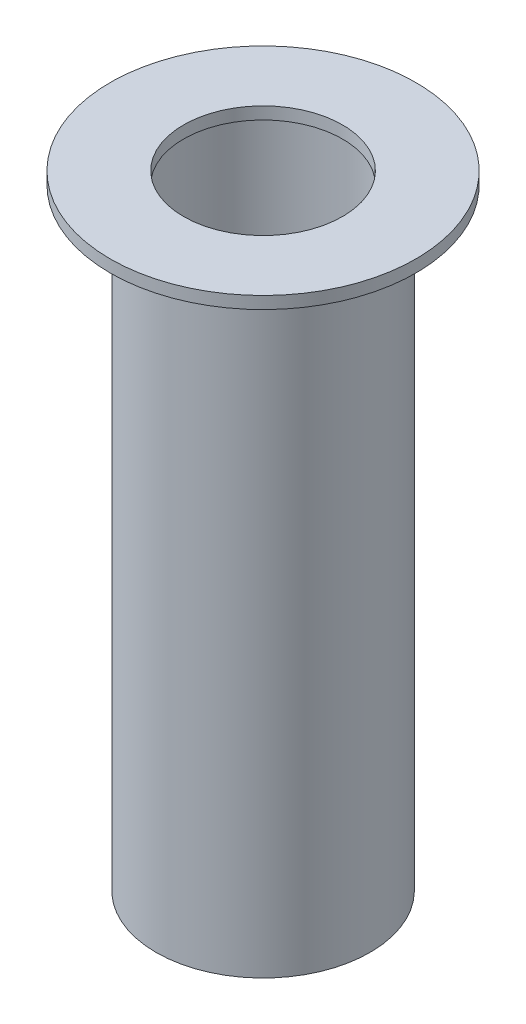
ISO-10303-21;
HEADER;
FILE_DESCRIPTION(('STEP AP214'),'2;1');
FILE_NAME('part.step','',(''),(''),'','','');
FILE_SCHEMA(('AUTOMOTIVE_DESIGN { 1 0 10303 214 1 1 1 1 }'));
ENDSEC;
DATA;
#1=APPLICATION_CONTEXT('core data for automotive mechanical design processes');
#2=APPLICATION_PROTOCOL_DEFINITION('international standard','automotive_design',2000,#1);
#3=PRODUCT_CONTEXT('',#1,'mechanical');
#4=PRODUCT('Part','Part','',(#3));
#5=PRODUCT_RELATED_PRODUCT_CATEGORY('part','',(#4));
#6=PRODUCT_DEFINITION_FORMATION('','',#4);
#7=PRODUCT_DEFINITION_CONTEXT('part definition',#1,'design');
#8=PRODUCT_DEFINITION('design','',#6,#7);
#9=PRODUCT_DEFINITION_SHAPE('','',#8);
#10=(LENGTH_UNIT() NAMED_UNIT(*) SI_UNIT(.MILLI.,.METRE.));
#11=(NAMED_UNIT(*) PLANE_ANGLE_UNIT() SI_UNIT($,.RADIAN.));
#12=(NAMED_UNIT(*) SI_UNIT($,.STERADIAN.) SOLID_ANGLE_UNIT());
#13=UNCERTAINTY_MEASURE_WITH_UNIT(LENGTH_MEASURE(1.E-05),#10,'distance_accuracy_value','');
#14=(GEOMETRIC_REPRESENTATION_CONTEXT(3) GLOBAL_UNCERTAINTY_ASSIGNED_CONTEXT((#13)) GLOBAL_UNIT_ASSIGNED_CONTEXT((#10,
#11,#12)) REPRESENTATION_CONTEXT('',''));
#15=CARTESIAN_POINT('',(0.,0.,0.));
#16=DIRECTION('',(0.,0.,1.));
#17=DIRECTION('',(1.,0.,0.));
#18=AXIS2_PLACEMENT_3D('',#15,#16,#17);
#19=CARTESIAN_POINT('',(0.,-20.,0.));
#20=DIRECTION('',(0.,1.,0.));
#21=DIRECTION('',(0.,0.,1.));
#22=AXIS2_PLACEMENT_3D('',#19,#20,#21);
#23=PLANE('',#22);
#24=CARTESIAN_POINT('',(0.,-20.,0.));
#25=DIRECTION('',(0.,1.,0.));
#26=DIRECTION('',(0.,0.,1.));
#27=AXIS2_PLACEMENT_3D('',#24,#25,#26);
#28=CIRCLE('',#27,7.);
#29=CARTESIAN_POINT('',(0.,-20.,7.));
#30=VERTEX_POINT('',#29);
#31=EDGE_CURVE('E35',#30,#30,#28,.T.);
#32=ORIENTED_EDGE('',*,*,#31,.F.);
#33=EDGE_LOOP('',(#32));
#34=FACE_BOUND('',#33,.T.);
#35=CARTESIAN_POINT('',(0.,-20.,0.));
#36=DIRECTION('',(0.,1.,0.));
#37=DIRECTION('',(0.,0.,1.));
#38=AXIS2_PLACEMENT_3D('',#35,#36,#37);
#39=CIRCLE('',#38,6.2);
#40=CARTESIAN_POINT('',(0.,-20.,6.2));
#41=VERTEX_POINT('',#40);
#42=EDGE_CURVE('E42',#41,#41,#39,.T.);
#43=ORIENTED_EDGE('',*,*,#42,.T.);
#44=EDGE_LOOP('',(#43));
#45=FACE_BOUND('',#44,.T.);
#46=ADVANCED_FACE('F31',(#34,#45),#23,.F.);
#47=CARTESIAN_POINT('',(0.,20.,0.));
#48=DIRECTION('',(0.,-1.,0.));
#49=DIRECTION('',(0.,0.,-1.));
#50=AXIS2_PLACEMENT_3D('',#47,#48,#49);
#51=CYLINDRICAL_SURFACE('',#50,7.);
#52=CARTESIAN_POINT('',(0.,20.,0.));
#53=DIRECTION('',(0.,1.,0.));
#54=DIRECTION('',(0.,0.,1.));
#55=AXIS2_PLACEMENT_3D('',#52,#53,#54);
#56=CIRCLE('',#55,7.);
#57=CARTESIAN_POINT('',(0.,20.,7.));
#58=VERTEX_POINT('',#57);
#59=EDGE_CURVE('E10',#58,#58,#56,.T.);
#60=ORIENTED_EDGE('',*,*,#59,.F.);
#61=EDGE_LOOP('',(#60));
#62=FACE_BOUND('',#61,.T.);
#63=ORIENTED_EDGE('',*,*,#31,.T.);
#64=EDGE_LOOP('',(#63));
#65=FACE_BOUND('',#64,.T.);
#66=ADVANCED_FACE('F33',(#62,#65),#51,.T.);
#67=CARTESIAN_POINT('',(0.,20.,0.));
#68=DIRECTION('',(0.,-1.,0.));
#69=DIRECTION('',(0.,0.,-1.));
#70=AXIS2_PLACEMENT_3D('',#67,#68,#69);
#71=CYLINDRICAL_SURFACE('',#70,6.2);
#72=CARTESIAN_POINT('',(0.,20.,0.));
#73=DIRECTION('',(0.,1.,0.));
#74=DIRECTION('',(0.,0.,1.));
#75=AXIS2_PLACEMENT_3D('',#72,#73,#74);
#76=CIRCLE('',#75,6.2);
#77=CARTESIAN_POINT('',(0.,20.,6.2));
#78=VERTEX_POINT('',#77);
#79=EDGE_CURVE('E46',#78,#78,#76,.T.);
#80=ORIENTED_EDGE('',*,*,#79,.T.);
#81=EDGE_LOOP('',(#80));
#82=FACE_BOUND('',#81,.T.);
#83=ORIENTED_EDGE('',*,*,#42,.F.);
#84=EDGE_LOOP('',(#83));
#85=FACE_BOUND('',#84,.T.);
#86=ADVANCED_FACE('F77',(#82,#85),#71,.F.);
#87=CARTESIAN_POINT('',(0.,20.,0.));
#88=DIRECTION('',(0.,1.,0.));
#89=DIRECTION('',(0.,0.,1.));
#90=AXIS2_PLACEMENT_3D('',#87,#88,#89);
#91=PLANE('',#90);
#92=CARTESIAN_POINT('',(0.,20.,0.));
#93=DIRECTION('',(0.,1.,0.));
#94=DIRECTION('',(0.,0.,1.));
#95=AXIS2_PLACEMENT_3D('',#92,#93,#94);
#96=CIRCLE('',#95,5.2);
#97=CARTESIAN_POINT('',(0.,20.,5.2));
#98=VERTEX_POINT('',#97);
#99=EDGE_CURVE('E56',#98,#98,#96,.T.);
#100=ORIENTED_EDGE('',*,*,#99,.T.);
#101=EDGE_LOOP('',(#100));
#102=FACE_BOUND('',#101,.T.);
#103=ORIENTED_EDGE('',*,*,#79,.F.);
#104=EDGE_LOOP('',(#103));
#105=FACE_BOUND('',#104,.T.);
#106=ADVANCED_FACE('F68',(#102,#105),#91,.F.);
#107=CARTESIAN_POINT('',(0.,20.8,0.));
#108=DIRECTION('',(0.,1.,0.));
#109=DIRECTION('',(0.,0.,1.));
#110=AXIS2_PLACEMENT_3D('',#107,#108,#109);
#111=PLANE('',#110);
#112=CARTESIAN_POINT('',(0.,20.8,0.));
#113=DIRECTION('',(0.,1.,0.));
#114=DIRECTION('',(0.,0.,1.));
#115=AXIS2_PLACEMENT_3D('',#112,#113,#114);
#116=CIRCLE('',#115,10.);
#117=CARTESIAN_POINT('',(0.,20.8,10.));
#118=VERTEX_POINT('',#117);
#119=EDGE_CURVE('E49',#118,#118,#116,.T.);
#120=ORIENTED_EDGE('',*,*,#119,.T.);
#121=EDGE_LOOP('',(#120));
#122=FACE_BOUND('',#121,.T.);
#123=CARTESIAN_POINT('',(0.,20.8,0.));
#124=DIRECTION('',(0.,1.,0.));
#125=DIRECTION('',(0.,0.,1.));
#126=AXIS2_PLACEMENT_3D('',#123,#124,#125);
#127=CIRCLE('',#126,5.2);
#128=CARTESIAN_POINT('',(0.,20.8,5.2));
#129=VERTEX_POINT('',#128);
#130=EDGE_CURVE('E53',#129,#129,#127,.T.);
#131=ORIENTED_EDGE('',*,*,#130,.F.);
#132=EDGE_LOOP('',(#131));
#133=FACE_BOUND('',#132,.T.);
#134=ADVANCED_FACE('F65',(#122,#133),#111,.T.);
#135=ORIENTED_EDGE('',*,*,#59,.T.);
#136=EDGE_LOOP('',(#135));
#137=FACE_BOUND('',#136,.T.);
#138=CARTESIAN_POINT('',(0.,20.,0.));
#139=DIRECTION('',(0.,1.,0.));
#140=DIRECTION('',(0.,0.,1.));
#141=AXIS2_PLACEMENT_3D('',#138,#139,#140);
#142=CIRCLE('',#141,10.);
#143=CARTESIAN_POINT('',(0.,20.,10.));
#144=VERTEX_POINT('',#143);
#145=EDGE_CURVE('E50',#144,#144,#142,.T.);
#146=ORIENTED_EDGE('',*,*,#145,.F.);
#147=EDGE_LOOP('',(#146));
#148=FACE_BOUND('',#147,.T.);
#149=ADVANCED_FACE('F67',(#137,#148),#91,.F.);
#150=CARTESIAN_POINT('',(0.,20.8,0.));
#151=DIRECTION('',(0.,-1.,0.));
#152=DIRECTION('',(0.,0.,-1.));
#153=AXIS2_PLACEMENT_3D('',#150,#151,#152);
#154=CYLINDRICAL_SURFACE('',#153,10.);
#155=ORIENTED_EDGE('',*,*,#119,.F.);
#156=EDGE_LOOP('',(#155));
#157=FACE_BOUND('',#156,.T.);
#158=ORIENTED_EDGE('',*,*,#145,.T.);
#159=EDGE_LOOP('',(#158));
#160=FACE_BOUND('',#159,.T.);
#161=ADVANCED_FACE('F75',(#157,#160),#154,.T.);
#162=CARTESIAN_POINT('',(0.,20.8,0.));
#163=DIRECTION('',(0.,-1.,0.));
#164=DIRECTION('',(0.,0.,-1.));
#165=AXIS2_PLACEMENT_3D('',#162,#163,#164);
#166=CYLINDRICAL_SURFACE('',#165,5.2);
#167=ORIENTED_EDGE('',*,*,#130,.T.);
#168=EDGE_LOOP('',(#167));
#169=FACE_BOUND('',#168,.T.);
#170=ORIENTED_EDGE('',*,*,#99,.F.);
#171=EDGE_LOOP('',(#170));
#172=FACE_BOUND('',#171,.T.);
#173=ADVANCED_FACE('F62',(#169,#172),#166,.F.);
#174=CLOSED_SHELL('',(#46,#66,#86,#106,#134,#149,#161,#173));
#175=MANIFOLD_SOLID_BREP('B2',#174);
#176=ADVANCED_BREP_SHAPE_REPRESENTATION('',(#18,#175),#14);
#177=SHAPE_DEFINITION_REPRESENTATION(#9,#176);
ENDSEC;
END-ISO-10303-21;
